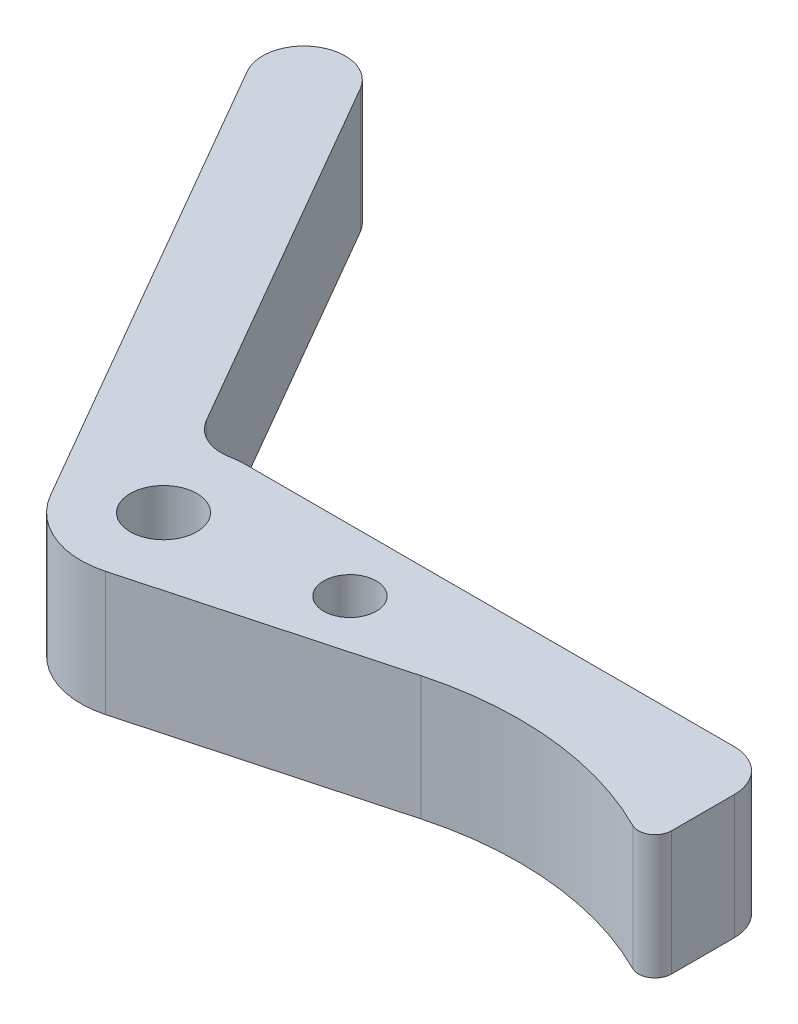
ISO-10303-21;
HEADER;
FILE_DESCRIPTION(('STEP AP214'),'2;1');
FILE_NAME('part.step','',(''),(''),'','','');
FILE_SCHEMA(('AUTOMOTIVE_DESIGN { 1 0 10303 214 1 1 1 1 }'));
ENDSEC;
DATA;
#1=APPLICATION_CONTEXT('core data for automotive mechanical design processes');
#2=APPLICATION_PROTOCOL_DEFINITION('international standard','automotive_design',2000,#1);
#3=PRODUCT_CONTEXT('',#1,'mechanical');
#4=PRODUCT('Part','Part','',(#3));
#5=PRODUCT_RELATED_PRODUCT_CATEGORY('part','',(#4));
#6=PRODUCT_DEFINITION_FORMATION('','',#4);
#7=PRODUCT_DEFINITION_CONTEXT('part definition',#1,'design');
#8=PRODUCT_DEFINITION('design','',#6,#7);
#9=PRODUCT_DEFINITION_SHAPE('','',#8);
#10=(LENGTH_UNIT() NAMED_UNIT(*) SI_UNIT(.MILLI.,.METRE.));
#11=(NAMED_UNIT(*) PLANE_ANGLE_UNIT() SI_UNIT($,.RADIAN.));
#12=(NAMED_UNIT(*) SI_UNIT($,.STERADIAN.) SOLID_ANGLE_UNIT());
#13=UNCERTAINTY_MEASURE_WITH_UNIT(LENGTH_MEASURE(1.E-05),#10,'distance_accuracy_value','');
#14=(GEOMETRIC_REPRESENTATION_CONTEXT(3) GLOBAL_UNCERTAINTY_ASSIGNED_CONTEXT((#13)) GLOBAL_UNIT_ASSIGNED_CONTEXT((#10,
#11,#12)) REPRESENTATION_CONTEXT('',''));
#15=CARTESIAN_POINT('',(0.,0.,0.));
#16=DIRECTION('',(0.,0.,1.));
#17=DIRECTION('',(1.,0.,0.));
#18=AXIS2_PLACEMENT_3D('',#15,#16,#17);
#19=CARTESIAN_POINT('',(0.,9.525,0.));
#20=DIRECTION('',(0.,-1.,0.));
#21=DIRECTION('',(0.,0.,-1.));
#22=AXIS2_PLACEMENT_3D('',#19,#20,#21);
#23=CYLINDRICAL_SURFACE('',#22,6.35);
#24=CARTESIAN_POINT('',(0.,0.,0.));
#25=DIRECTION('',(0.,1.,0.));
#26=DIRECTION('',(0.,0.,1.));
#27=AXIS2_PLACEMENT_3D('',#24,#25,#26);
#28=CIRCLE('',#27,6.35);
#29=CARTESIAN_POINT('',(-5.49926131403119,0.,3.175));
#30=VERTEX_POINT('',#29);
#31=CARTESIAN_POINT('',(1.66397149352057,0.,6.12810728273836));
#32=VERTEX_POINT('',#31);
#33=EDGE_CURVE('E169',#30,#32,#28,.T.);
#34=ORIENTED_EDGE('',*,*,#33,.T.);
#35=DIRECTION('',(0.,-1.,0.));
#36=VECTOR('',#35,1.);
#37=CARTESIAN_POINT('',(1.66397149352057,9.525,6.12810728273836));
#38=LINE('',#37,#36);
#39=CARTESIAN_POINT('',(1.66397149352057,9.525,6.12810728273836));
#40=VERTEX_POINT('',#39);
#41=EDGE_CURVE('E150',#40,#32,#38,.T.);
#42=ORIENTED_EDGE('',*,*,#41,.F.);
#43=CARTESIAN_POINT('',(0.,9.525,0.));
#44=DIRECTION('',(0.,1.,0.));
#45=DIRECTION('',(0.,0.,1.));
#46=AXIS2_PLACEMENT_3D('',#43,#44,#45);
#47=CIRCLE('',#46,6.35);
#48=CARTESIAN_POINT('',(-5.49926131403119,9.525,3.175));
#49=VERTEX_POINT('',#48);
#50=EDGE_CURVE('E156',#49,#40,#47,.T.);
#51=ORIENTED_EDGE('',*,*,#50,.F.);
#52=DIRECTION('',(0.,-1.,0.));
#53=VECTOR('',#52,1.);
#54=CARTESIAN_POINT('',(-5.49926131403119,9.525,3.175));
#55=LINE('',#54,#53);
#56=EDGE_CURVE('E241',#49,#30,#55,.T.);
#57=ORIENTED_EDGE('',*,*,#56,.T.);
#58=EDGE_LOOP('',(#34,#42,#51,#57));
#59=FACE_BOUND('',#58,.T.);
#60=ADVANCED_FACE('F51',(#59),#23,.T.);
#61=CARTESIAN_POINT('',(1.66397149352057,9.525,6.12810728273836));
#62=DIRECTION('',(-0.26204275488513,0.,-0.965056264998167));
#63=DIRECTION('',(-0.965056264998167,0.,0.26204275488513));
#64=AXIS2_PLACEMENT_3D('',#61,#62,#63);
#65=PLANE('',#64);
#66=DIRECTION('',(0.965056264998167,0.,-0.26204275488513));
#67=VECTOR('',#66,1.);
#68=CARTESIAN_POINT('',(1.66397149352057,0.,6.12810728273836));
#69=LINE('',#68,#67);
#70=CARTESIAN_POINT('',(20.7139714935206,0.,0.955440505044106));
#71=VERTEX_POINT('',#70);
#72=EDGE_CURVE('E232',#32,#71,#69,.T.);
#73=ORIENTED_EDGE('',*,*,#72,.T.);
#74=DIRECTION('',(0.,-1.,0.));
#75=VECTOR('',#74,1.);
#76=CARTESIAN_POINT('',(20.7139714935206,9.525,0.955440505044106));
#77=LINE('',#76,#75);
#78=CARTESIAN_POINT('',(20.7139714935206,9.525,0.955440505044106));
#79=VERTEX_POINT('',#78);
#80=EDGE_CURVE('E153',#79,#71,#77,.T.);
#81=ORIENTED_EDGE('',*,*,#80,.F.);
#82=DIRECTION('',(0.965056264998167,0.,-0.26204275488513));
#83=VECTOR('',#82,1.);
#84=CARTESIAN_POINT('',(1.66397149352057,9.525,6.12810728273836));
#85=LINE('',#84,#83);
#86=EDGE_CURVE('E146',#40,#79,#85,.T.);
#87=ORIENTED_EDGE('',*,*,#86,.F.);
#88=ORIENTED_EDGE('',*,*,#41,.T.);
#89=EDGE_LOOP('',(#73,#81,#87,#88));
#90=FACE_BOUND('',#89,.T.);
#91=ADVANCED_FACE('F148',(#90),#65,.F.);
#92=CARTESIAN_POINT('',(27.3698574676029,9.525,25.4678696359975));
#93=DIRECTION('',(0.,-1.,0.));
#94=DIRECTION('',(0.,0.,-1.));
#95=AXIS2_PLACEMENT_3D('',#92,#93,#94);
#96=CYLINDRICAL_SURFACE('',#95,25.4);
#97=CARTESIAN_POINT('',(27.3698574676029,0.,25.4678696359975));
#98=DIRECTION('',(0.,1.,0.));
#99=DIRECTION('',(0.,0.,1.));
#100=AXIS2_PLACEMENT_3D('',#97,#98,#99);
#101=CIRCLE('',#100,25.4);
#102=CARTESIAN_POINT('',(38.7985646413144,0.,2.78429292645824));
#103=VERTEX_POINT('',#102);
#104=EDGE_CURVE('E228',#71,#103,#101,.F.);
#105=ORIENTED_EDGE('',*,*,#104,.T.);
#106=DIRECTION('',(0.,-1.,0.));
#107=VECTOR('',#106,1.);
#108=CARTESIAN_POINT('',(38.7985646413144,9.525,2.78429292645824));
#109=LINE('',#108,#107);
#110=CARTESIAN_POINT('',(38.7985646413144,9.525,2.78429292645824));
#111=VERTEX_POINT('',#110);
#112=EDGE_CURVE('E59',#103,#111,#109,.F.);
#113=ORIENTED_EDGE('',*,*,#112,.T.);
#114=CARTESIAN_POINT('',(27.3698574676029,9.525,25.4678696359975));
#115=DIRECTION('',(0.,1.,0.));
#116=DIRECTION('',(0.,0.,1.));
#117=AXIS2_PLACEMENT_3D('',#114,#115,#116);
#118=CIRCLE('',#117,25.4);
#119=EDGE_CURVE('E155',#79,#111,#118,.F.);
#120=ORIENTED_EDGE('',*,*,#119,.F.);
#121=ORIENTED_EDGE('',*,*,#80,.T.);
#122=EDGE_LOOP('',(#105,#113,#120,#121));
#123=FACE_BOUND('',#122,.T.);
#124=ADVANCED_FACE('F270',(#123),#96,.F.);
#125=CARTESIAN_POINT('',(40.64,9.525,0.));
#126=DIRECTION('',(1.,0.,0.));
#127=DIRECTION('',(0.,0.,-1.));
#128=AXIS2_PLACEMENT_3D('',#125,#126,#127);
#129=PLANE('',#128);
#130=DIRECTION('',(0.,0.,1.));
#131=VECTOR('',#130,1.);
#132=CARTESIAN_POINT('',(40.64,9.525,0.));
#133=LINE('',#132,#131);
#134=CARTESIAN_POINT('',(40.64,9.525,-3.175));
#135=VERTEX_POINT('',#134);
#136=CARTESIAN_POINT('',(40.64,9.525,1.65011409098128));
#137=VERTEX_POINT('',#136);
#138=EDGE_CURVE('E222',#135,#137,#133,.T.);
#139=ORIENTED_EDGE('',*,*,#138,.T.);
#140=DIRECTION('',(0.,1.,0.));
#141=VECTOR('',#140,1.);
#142=CARTESIAN_POINT('',(40.64,0.,1.65011409098128));
#143=LINE('',#142,#141);
#144=CARTESIAN_POINT('',(40.64,0.,1.65011409098128));
#145=VERTEX_POINT('',#144);
#146=EDGE_CURVE('E206',#137,#145,#143,.F.);
#147=ORIENTED_EDGE('',*,*,#146,.T.);
#148=DIRECTION('',(0.,0.,1.));
#149=VECTOR('',#148,1.);
#150=CARTESIAN_POINT('',(40.64,0.,0.));
#151=LINE('',#150,#149);
#152=CARTESIAN_POINT('',(40.64,0.,-3.175));
#153=VERTEX_POINT('',#152);
#154=EDGE_CURVE('E219',#153,#145,#151,.T.);
#155=ORIENTED_EDGE('',*,*,#154,.F.);
#156=DIRECTION('',(0.,-1.,0.));
#157=VECTOR('',#156,1.);
#158=CARTESIAN_POINT('',(40.64,9.525,-3.175));
#159=LINE('',#158,#157);
#160=EDGE_CURVE('E200',#153,#135,#159,.F.);
#161=ORIENTED_EDGE('',*,*,#160,.T.);
#162=EDGE_LOOP('',(#139,#147,#155,#161));
#163=FACE_BOUND('',#162,.T.);
#164=ADVANCED_FACE('F218',(#163),#129,.T.);
#165=CARTESIAN_POINT('',(0.,9.525,-6.35));
#166=DIRECTION('',(0.,0.,-1.));
#167=DIRECTION('',(-1.,0.,0.));
#168=AXIS2_PLACEMENT_3D('',#165,#166,#167);
#169=PLANE('',#168);
#170=DIRECTION('',(1.,0.,0.));
#171=VECTOR('',#170,1.);
#172=CARTESIAN_POINT('',(0.,9.525,-6.35));
#173=LINE('',#172,#171);
#174=CARTESIAN_POINT('',(0.,9.525,-6.35));
#175=VERTEX_POINT('',#174);
#176=CARTESIAN_POINT('',(37.465,9.525,-6.35));
#177=VERTEX_POINT('',#176);
#178=EDGE_CURVE('E257',#175,#177,#173,.T.);
#179=ORIENTED_EDGE('',*,*,#178,.T.);
#180=DIRECTION('',(0.,-1.,0.));
#181=VECTOR('',#180,1.);
#182=CARTESIAN_POINT('',(37.465,9.525,-6.35));
#183=LINE('',#182,#181);
#184=CARTESIAN_POINT('',(37.465,0.,-6.35));
#185=VERTEX_POINT('',#184);
#186=EDGE_CURVE('E197',#177,#185,#183,.T.);
#187=ORIENTED_EDGE('',*,*,#186,.T.);
#188=DIRECTION('',(1.,0.,0.));
#189=VECTOR('',#188,1.);
#190=CARTESIAN_POINT('',(0.,0.,-6.35));
#191=LINE('',#190,#189);
#192=CARTESIAN_POINT('',(0.,0.,-6.35));
#193=VERTEX_POINT('',#192);
#194=EDGE_CURVE('E227',#193,#185,#191,.T.);
#195=ORIENTED_EDGE('',*,*,#194,.F.);
#196=DIRECTION('',(0.,-1.,0.));
#197=VECTOR('',#196,1.);
#198=CARTESIAN_POINT('',(0.,9.525,-6.35));
#199=LINE('',#198,#197);
#200=EDGE_CURVE('E175',#175,#193,#199,.T.);
#201=ORIENTED_EDGE('',*,*,#200,.F.);
#202=EDGE_LOOP('',(#179,#187,#195,#201));
#203=FACE_BOUND('',#202,.T.);
#204=ADVANCED_FACE('F255',(#203),#169,.T.);
#205=CARTESIAN_POINT('',(-1.16033160234599,0.,-6.24308662222439));
#206=VERTEX_POINT('',#205);
#207=EDGE_CURVE('E230',#193,#206,#28,.T.);
#208=ORIENTED_EDGE('',*,*,#207,.T.);
#209=DIRECTION('',(0.,-1.,0.));
#210=VECTOR('',#209,1.);
#211=CARTESIAN_POINT('',(-1.16033160234599,9.525,-6.24308662222439));
#212=LINE('',#211,#210);
#213=CARTESIAN_POINT('',(-1.16033160234599,9.525,-6.24308662222439));
#214=VERTEX_POINT('',#213);
#215=EDGE_CURVE('E195',#206,#214,#212,.F.);
#216=ORIENTED_EDGE('',*,*,#215,.T.);
#217=EDGE_CURVE('E167',#175,#214,#47,.T.);
#218=ORIENTED_EDGE('',*,*,#217,.F.);
#219=ORIENTED_EDGE('',*,*,#200,.T.);
#220=EDGE_LOOP('',(#208,#216,#218,#219));
#221=FACE_BOUND('',#220,.T.);
#222=ADVANCED_FACE('F246',(#221),#23,.T.);
#223=CARTESIAN_POINT('',(0.,9.525,0.));
#224=DIRECTION('',(-0.866025403784439,0.,0.499999999999999));
#225=DIRECTION('',(0.5,0.,0.866025403784439));
#226=AXIS2_PLACEMENT_3D('',#223,#224,#225);
#227=PLANE('',#226);
#228=DIRECTION('',(-0.5,0.,-0.866025403784439));
#229=VECTOR('',#228,1.);
#230=CARTESIAN_POINT('',(0.,0.,0.));
#231=LINE('',#230,#229);
#232=CARTESIAN_POINT('',(-4.49012806053458,0.,-7.77712993333659));
#233=VERTEX_POINT('',#232);
#234=CARTESIAN_POINT('',(-20.6375,0.,-35.7451985412028));
#235=VERTEX_POINT('',#234);
#236=EDGE_CURVE('E236',#233,#235,#231,.T.);
#237=ORIENTED_EDGE('',*,*,#236,.T.);
#238=DIRECTION('',(0.,-1.,0.));
#239=VECTOR('',#238,1.);
#240=CARTESIAN_POINT('',(-20.6375,9.525,-35.7451985412027));
#241=LINE('',#240,#239);
#242=CARTESIAN_POINT('',(-20.6375,9.525,-35.7451985412028));
#243=VERTEX_POINT('',#242);
#244=EDGE_CURVE('E193',#235,#243,#241,.F.);
#245=ORIENTED_EDGE('',*,*,#244,.T.);
#246=DIRECTION('',(-0.5,0.,-0.866025403784439));
#247=VECTOR('',#246,1.);
#248=CARTESIAN_POINT('',(0.,9.525,0.));
#249=LINE('',#248,#247);
#250=CARTESIAN_POINT('',(-4.49012806053458,9.525,-7.77712993333659));
#251=VERTEX_POINT('',#250);
#252=EDGE_CURVE('E265',#251,#243,#249,.T.);
#253=ORIENTED_EDGE('',*,*,#252,.F.);
#254=DIRECTION('',(0.,1.,0.));
#255=VECTOR('',#254,1.);
#256=CARTESIAN_POINT('',(-4.49012806053457,0.,-7.77712993333659));
#257=LINE('',#256,#255);
#258=EDGE_CURVE('E190',#251,#233,#257,.F.);
#259=ORIENTED_EDGE('',*,*,#258,.T.);
#260=EDGE_LOOP('',(#237,#245,#253,#259));
#261=FACE_BOUND('',#260,.T.);
#262=ADVANCED_FACE('F289',(#261),#227,.F.);
#263=CARTESIAN_POINT('',(0.,9.525,0.));
#264=DIRECTION('',(0.,-1.,0.));
#265=DIRECTION('',(0.,0.,-1.));
#266=AXIS2_PLACEMENT_3D('',#263,#264,#265);
#267=CYLINDRICAL_SURFACE('',#266,2.5527);
#268=CARTESIAN_POINT('',(0.,9.525,0.));
#269=DIRECTION('',(0.,1.,0.));
#270=DIRECTION('',(0.,0.,1.));
#271=AXIS2_PLACEMENT_3D('',#268,#269,#270);
#272=CIRCLE('',#271,2.5527);
#273=CARTESIAN_POINT('',(0.,9.525,-2.5527));
#274=VERTEX_POINT('',#273);
#275=EDGE_CURVE('E165',#274,#274,#272,.T.);
#276=CARTESIAN_POINT('',(0.,0.,0.));
#277=DIRECTION('',(0.,1.,0.));
#278=DIRECTION('',(0.,0.,1.));
#279=AXIS2_PLACEMENT_3D('',#276,#277,#278);
#280=CIRCLE('',#279,2.5527);
#281=CARTESIAN_POINT('',(0.,0.,-2.5527));
#282=VERTEX_POINT('',#281);
#283=EDGE_CURVE('E210',#282,#282,#280,.T.);
#284=CARTESIAN_POINT('',(0.,9.525,-2.5527));
#285=CARTESIAN_POINT('',(0.,9.42578125,-2.5527));
#286=CARTESIAN_POINT('',(0.,9.3265625,-2.5527));
#287=CARTESIAN_POINT('',(0.,9.128125,-2.5527));
#288=CARTESIAN_POINT('',(0.,9.02890625,-2.5527));
#289=CARTESIAN_POINT('',(0.,8.83046875,-2.5527));
#290=CARTESIAN_POINT('',(0.,8.73125,-2.5527));
#291=CARTESIAN_POINT('',(0.,8.5328125,-2.5527));
#292=CARTESIAN_POINT('',(0.,8.43359375,-2.5527));
#293=CARTESIAN_POINT('',(0.,8.23515625,-2.5527));
#294=CARTESIAN_POINT('',(0.,8.1359375,-2.5527));
#295=CARTESIAN_POINT('',(0.,7.9375,-2.5527));
#296=CARTESIAN_POINT('',(0.,7.83828125,-2.5527));
#297=CARTESIAN_POINT('',(0.,7.63984375,-2.5527));
#298=CARTESIAN_POINT('',(0.,7.540625,-2.5527));
#299=CARTESIAN_POINT('',(0.,7.3421875,-2.5527));
#300=CARTESIAN_POINT('',(0.,7.24296875,-2.5527));
#301=CARTESIAN_POINT('',(0.,7.04453125,-2.5527));
#302=CARTESIAN_POINT('',(0.,6.9453125,-2.5527));
#303=CARTESIAN_POINT('',(0.,6.746875,-2.5527));
#304=CARTESIAN_POINT('',(0.,6.64765625,-2.5527));
#305=CARTESIAN_POINT('',(0.,6.44921875,-2.5527));
#306=CARTESIAN_POINT('',(0.,6.35,-2.5527));
#307=CARTESIAN_POINT('',(0.,6.1515625,-2.5527));
#308=CARTESIAN_POINT('',(0.,6.05234375,-2.5527));
#309=CARTESIAN_POINT('',(0.,5.85390625,-2.5527));
#310=CARTESIAN_POINT('',(0.,5.7546875,-2.5527));
#311=CARTESIAN_POINT('',(0.,5.55625,-2.5527));
#312=CARTESIAN_POINT('',(0.,5.45703125,-2.5527));
#313=CARTESIAN_POINT('',(0.,5.25859375,-2.5527));
#314=CARTESIAN_POINT('',(0.,5.159375,-2.5527));
#315=CARTESIAN_POINT('',(0.,4.9609375,-2.5527));
#316=CARTESIAN_POINT('',(0.,4.86171875,-2.5527));
#317=CARTESIAN_POINT('',(0.,4.66328125,-2.5527));
#318=CARTESIAN_POINT('',(0.,4.5640625,-2.5527));
#319=CARTESIAN_POINT('',(0.,4.365625,-2.5527));
#320=CARTESIAN_POINT('',(0.,4.26640625,-2.5527));
#321=CARTESIAN_POINT('',(0.,4.06796875,-2.5527));
#322=CARTESIAN_POINT('',(0.,3.96875,-2.5527));
#323=CARTESIAN_POINT('',(0.,3.7703125,-2.5527));
#324=CARTESIAN_POINT('',(0.,3.67109375,-2.5527));
#325=CARTESIAN_POINT('',(0.,3.47265625,-2.5527));
#326=CARTESIAN_POINT('',(0.,3.3734375,-2.5527));
#327=CARTESIAN_POINT('',(0.,3.175,-2.5527));
#328=CARTESIAN_POINT('',(0.,3.07578125,-2.5527));
#329=CARTESIAN_POINT('',(0.,2.87734375,-2.5527));
#330=CARTESIAN_POINT('',(0.,2.778125,-2.5527));
#331=CARTESIAN_POINT('',(0.,2.5796875,-2.5527));
#332=CARTESIAN_POINT('',(0.,2.48046875,-2.5527));
#333=CARTESIAN_POINT('',(0.,2.28203125,-2.5527));
#334=CARTESIAN_POINT('',(0.,2.1828125,-2.5527));
#335=CARTESIAN_POINT('',(0.,1.984375,-2.5527));
#336=CARTESIAN_POINT('',(0.,1.88515625,-2.5527));
#337=CARTESIAN_POINT('',(0.,1.68671875,-2.5527));
#338=CARTESIAN_POINT('',(0.,1.5875,-2.5527));
#339=CARTESIAN_POINT('',(0.,1.3890625,-2.5527));
#340=CARTESIAN_POINT('',(0.,1.28984375,-2.5527));
#341=CARTESIAN_POINT('',(0.,1.09140625,-2.5527));
#342=CARTESIAN_POINT('',(0.,0.992187500000001,-2.5527));
#343=CARTESIAN_POINT('',(0.,0.793750000000001,-2.5527));
#344=CARTESIAN_POINT('',(0.,0.69453125,-2.5527));
#345=CARTESIAN_POINT('',(0.,0.49609375,-2.5527));
#346=CARTESIAN_POINT('',(0.,0.396875,-2.5527));
#347=CARTESIAN_POINT('',(0.,0.1984375,-2.5527));
#348=CARTESIAN_POINT('',(0.,0.0992187500000001,-2.5527));
#349=CARTESIAN_POINT('',(0.,0.,-2.5527));
#350=B_SPLINE_CURVE_WITH_KNOTS('',3,(#284,#285,#286,#287,#288,#289,#290,#291,#292,#293,#294,
#295,#296,#297,#298,#299,#300,#301,#302,#303,#304,#305,#306,#307,#308,#309,#310,#311,#312,#313,
#314,#315,#316,#317,#318,#319,#320,#321,#322,#323,#324,#325,#326,#327,#328,#329,#330,#331,#332,
#333,#334,#335,#336,#337,#338,#339,#340,#341,#342,#343,#344,#345,#346,#347,#348,#349),
.UNSPECIFIED.,.F.,.F.,(4,2,2,2,2,2,2,2,2,2,2,2,2,2,2,2,2,2,2,2,2,2,2,2,2,2,2,2,2,2,2,2,4),(0.,
0.29765625,0.5953125,0.892968750000001,1.190625,1.48828125,1.7859375,2.08359375,2.38125,
2.67890625,2.9765625,3.27421875,3.571875,3.86953125,4.1671875,4.46484375,4.7625,5.06015625,
5.3578125,5.65546875,5.953125,6.25078125,6.5484375,6.84609375,7.14375,7.44140625,7.7390625,
8.03671875,8.334375,8.63203125,8.9296875,9.22734375,9.525),.UNSPECIFIED.);
#351=EDGE_CURVE('BSEAM294',#274,#282,#350,.T.);
#352=ORIENTED_EDGE('',*,*,#275,.T.);
#353=ORIENTED_EDGE('',*,*,#283,.F.);
#354=ORIENTED_EDGE('',*,*,#351,.T.);
#355=ORIENTED_EDGE('',*,*,#351,.F.);
#356=EDGE_LOOP('',(#352,#354,#353,#355));
#357=FACE_BOUND('',#356,.T.);
#358=ADVANCED_FACE('F294',(#357),#267,.F.);
#359=CARTESIAN_POINT('',(-5.49926131403119,9.525,3.175));
#360=DIRECTION('',(0.866025403784439,0.,-0.499999999999999));
#361=DIRECTION('',(-0.5,0.,-0.866025403784439));
#362=AXIS2_PLACEMENT_3D('',#359,#360,#361);
#363=PLANE('',#362);
#364=DIRECTION('',(0.5,0.,0.866025403784439));
#365=VECTOR('',#364,1.);
#366=CARTESIAN_POINT('',(-5.49926131403119,9.525,3.175));
#367=LINE('',#366,#365);
#368=CARTESIAN_POINT('',(-26.1367613140312,9.525,-32.5701985412028));
#369=VERTEX_POINT('',#368);
#370=EDGE_CURVE('E161',#369,#49,#367,.T.);
#371=ORIENTED_EDGE('',*,*,#370,.F.);
#372=DIRECTION('',(0.,-1.,0.));
#373=VECTOR('',#372,1.);
#374=CARTESIAN_POINT('',(-26.1367613140312,9.525,-32.5701985412027));
#375=LINE('',#374,#373);
#376=CARTESIAN_POINT('',(-26.1367613140312,0.,-32.5701985412028));
#377=VERTEX_POINT('',#376);
#378=EDGE_CURVE('E170',#369,#377,#375,.T.);
#379=ORIENTED_EDGE('',*,*,#378,.T.);
#380=DIRECTION('',(0.5,0.,0.866025403784439));
#381=VECTOR('',#380,1.);
#382=CARTESIAN_POINT('',(-5.49926131403119,0.,3.175));
#383=LINE('',#382,#381);
#384=EDGE_CURVE('E239',#377,#30,#383,.T.);
#385=ORIENTED_EDGE('',*,*,#384,.T.);
#386=ORIENTED_EDGE('',*,*,#56,.F.);
#387=EDGE_LOOP('',(#371,#379,#385,#386));
#388=FACE_BOUND('',#387,.T.);
#389=ADVANCED_FACE('F305',(#388),#363,.F.);
#390=CARTESIAN_POINT('',(0.,9.525,0.));
#391=DIRECTION('',(0.,1.,0.));
#392=DIRECTION('',(0.,0.,1.));
#393=AXIS2_PLACEMENT_3D('',#390,#391,#392);
#394=PLANE('',#393);
#395=CARTESIAN_POINT('',(12.7,9.525,-1.60925864244061));
#396=DIRECTION('',(0.,1.,0.));
#397=DIRECTION('',(0.,0.,1.));
#398=AXIS2_PLACEMENT_3D('',#395,#396,#397);
#399=CIRCLE('',#398,2.0193);
#400=CARTESIAN_POINT('',(12.7,9.525,0.410041357559393));
#401=VERTEX_POINT('',#400);
#402=EDGE_CURVE('E349',#401,#401,#399,.T.);
#403=ORIENTED_EDGE('',*,*,#402,.F.);
#404=EDGE_LOOP('',(#403));
#405=FACE_BOUND('',#404,.T.);
#406=ORIENTED_EDGE('',*,*,#275,.F.);
#407=EDGE_LOOP('',(#406));
#408=FACE_BOUND('',#407,.T.);
#409=ORIENTED_EDGE('',*,*,#119,.T.);
#410=CARTESIAN_POINT('',(39.37,9.525,1.65011409098128));
#411=DIRECTION('',(0.,1.,0.));
#412=DIRECTION('',(0.,0.,1.));
#413=AXIS2_PLACEMENT_3D('',#410,#411,#412);
#414=CIRCLE('',#413,1.27);
#415=EDGE_CURVE('E11',#111,#137,#414,.T.);
#416=ORIENTED_EDGE('',*,*,#415,.T.);
#417=ORIENTED_EDGE('',*,*,#138,.F.);
#418=CARTESIAN_POINT('',(37.465,9.525,-3.175));
#419=DIRECTION('',(0.,1.,0.));
#420=DIRECTION('',(0.,0.,1.));
#421=AXIS2_PLACEMENT_3D('',#418,#419,#420);
#422=CIRCLE('',#421,3.175);
#423=EDGE_CURVE('E184',#135,#177,#422,.T.);
#424=ORIENTED_EDGE('',*,*,#423,.T.);
#425=ORIENTED_EDGE('',*,*,#178,.F.);
#426=ORIENTED_EDGE('',*,*,#217,.T.);
#427=CARTESIAN_POINT('',(-1.74049740351898,9.525,-9.36462993333659));
#428=DIRECTION('',(0.,1.,0.));
#429=DIRECTION('',(0.,0.,1.));
#430=AXIS2_PLACEMENT_3D('',#427,#428,#429);
#431=CIRCLE('',#430,3.175);
#432=EDGE_CURVE('E204',#214,#251,#431,.F.);
#433=ORIENTED_EDGE('',*,*,#432,.T.);
#434=ORIENTED_EDGE('',*,*,#252,.T.);
#435=CARTESIAN_POINT('',(-23.3871306570156,9.525,-34.1576985412027));
#436=DIRECTION('',(0.,1.,0.));
#437=DIRECTION('',(0.,0.,1.));
#438=AXIS2_PLACEMENT_3D('',#435,#436,#437);
#439=CIRCLE('',#438,3.175);
#440=CARTESIAN_POINT('',(-24.9746306570156,9.525,-36.9073291982183));
#441=VERTEX_POINT('',#440);
#442=EDGE_CURVE('E186',#243,#441,#439,.T.);
#443=ORIENTED_EDGE('',*,*,#442,.T.);
#444=CARTESIAN_POINT('',(-23.3871306570156,9.525,-34.1576985412027));
#445=DIRECTION('',(0.,1.,0.));
#446=DIRECTION('',(0.,0.,1.));
#447=AXIS2_PLACEMENT_3D('',#444,#445,#446);
#448=CIRCLE('',#447,3.175);
#449=EDGE_CURVE('E188',#441,#369,#448,.T.);
#450=ORIENTED_EDGE('',*,*,#449,.T.);
#451=ORIENTED_EDGE('',*,*,#370,.T.);
#452=ORIENTED_EDGE('',*,*,#50,.T.);
#453=ORIENTED_EDGE('',*,*,#86,.T.);
#454=EDGE_LOOP('',(#409,#416,#417,#424,#425,#426,#433,#434,#443,#450,#451,#452,#453));
#455=FACE_BOUND('',#454,.T.);
#456=ADVANCED_FACE('F159',(#405,#408,#455),#394,.T.);
#457=CARTESIAN_POINT('',(0.,0.,0.));
#458=DIRECTION('',(0.,1.,0.));
#459=DIRECTION('',(0.,0.,1.));
#460=AXIS2_PLACEMENT_3D('',#457,#458,#459);
#461=PLANE('',#460);
#462=CARTESIAN_POINT('',(12.7,0.,-1.60925864244061));
#463=DIRECTION('',(0.,1.,0.));
#464=DIRECTION('',(0.,0.,1.));
#465=AXIS2_PLACEMENT_3D('',#462,#463,#464);
#466=CIRCLE('',#465,2.0193);
#467=CARTESIAN_POINT('',(12.7,0.,0.410041357559392));
#468=VERTEX_POINT('',#467);
#469=EDGE_CURVE('E211',#468,#468,#466,.T.);
#470=ORIENTED_EDGE('',*,*,#469,.T.);
#471=EDGE_LOOP('',(#470));
#472=FACE_BOUND('',#471,.T.);
#473=ORIENTED_EDGE('',*,*,#283,.T.);
#474=EDGE_LOOP('',(#473));
#475=FACE_BOUND('',#474,.T.);
#476=ORIENTED_EDGE('',*,*,#154,.T.);
#477=CARTESIAN_POINT('',(39.37,0.,1.65011409098128));
#478=DIRECTION('',(0.,1.,0.));
#479=DIRECTION('',(0.,0.,1.));
#480=AXIS2_PLACEMENT_3D('',#477,#478,#479);
#481=CIRCLE('',#480,1.27);
#482=EDGE_CURVE('E73',#145,#103,#481,.F.);
#483=ORIENTED_EDGE('',*,*,#482,.T.);
#484=ORIENTED_EDGE('',*,*,#104,.F.);
#485=ORIENTED_EDGE('',*,*,#72,.F.);
#486=ORIENTED_EDGE('',*,*,#33,.F.);
#487=ORIENTED_EDGE('',*,*,#384,.F.);
#488=CARTESIAN_POINT('',(-23.3871306570156,0.,-34.1576985412027));
#489=DIRECTION('',(0.,1.,0.));
#490=DIRECTION('',(0.,0.,1.));
#491=AXIS2_PLACEMENT_3D('',#488,#489,#490);
#492=CIRCLE('',#491,3.175);
#493=CARTESIAN_POINT('',(-24.9746306570156,0.,-36.9073291982183));
#494=VERTEX_POINT('',#493);
#495=EDGE_CURVE('E182',#377,#494,#492,.F.);
#496=ORIENTED_EDGE('',*,*,#495,.T.);
#497=CARTESIAN_POINT('',(-23.3871306570156,0.,-34.1576985412027));
#498=DIRECTION('',(0.,1.,0.));
#499=DIRECTION('',(0.,0.,1.));
#500=AXIS2_PLACEMENT_3D('',#497,#498,#499);
#501=CIRCLE('',#500,3.175);
#502=EDGE_CURVE('E180',#494,#235,#501,.F.);
#503=ORIENTED_EDGE('',*,*,#502,.T.);
#504=ORIENTED_EDGE('',*,*,#236,.F.);
#505=CARTESIAN_POINT('',(-1.74049740351898,0.,-9.36462993333659));
#506=DIRECTION('',(0.,1.,0.));
#507=DIRECTION('',(0.,0.,1.));
#508=AXIS2_PLACEMENT_3D('',#505,#506,#507);
#509=CIRCLE('',#508,3.175);
#510=EDGE_CURVE('E202',#233,#206,#509,.T.);
#511=ORIENTED_EDGE('',*,*,#510,.T.);
#512=ORIENTED_EDGE('',*,*,#207,.F.);
#513=ORIENTED_EDGE('',*,*,#194,.T.);
#514=CARTESIAN_POINT('',(37.465,0.,-3.175));
#515=DIRECTION('',(0.,1.,0.));
#516=DIRECTION('',(0.,0.,1.));
#517=AXIS2_PLACEMENT_3D('',#514,#515,#516);
#518=CIRCLE('',#517,3.175);
#519=EDGE_CURVE('E173',#185,#153,#518,.F.);
#520=ORIENTED_EDGE('',*,*,#519,.T.);
#521=EDGE_LOOP('',(#476,#483,#484,#485,#486,#487,#496,#503,#504,#511,#512,#513,#520));
#522=FACE_BOUND('',#521,.T.);
#523=ADVANCED_FACE('F225',(#472,#475,#522),#461,.F.);
#524=CARTESIAN_POINT('',(-23.3871306570156,9.525,-34.1576985412027));
#525=DIRECTION('',(0.,-1.,0.));
#526=DIRECTION('',(0.,0.,-1.));
#527=AXIS2_PLACEMENT_3D('',#524,#525,#526);
#528=CYLINDRICAL_SURFACE('',#527,3.175);
#529=DIRECTION('',(0.,-1.,0.));
#530=VECTOR('',#529,1.);
#531=CARTESIAN_POINT('',(-24.9746306570156,9.525,-36.9073291982183));
#532=LINE('',#531,#530);
#533=EDGE_CURVE('E207',#441,#494,#532,.T.);
#534=ORIENTED_EDGE('',*,*,#533,.F.);
#535=ORIENTED_EDGE('',*,*,#442,.F.);
#536=ORIENTED_EDGE('',*,*,#244,.F.);
#537=ORIENTED_EDGE('',*,*,#502,.F.);
#538=EDGE_LOOP('',(#534,#535,#536,#537));
#539=FACE_BOUND('',#538,.T.);
#540=ADVANCED_FACE('F310',(#539),#528,.T.);
#541=CARTESIAN_POINT('',(-23.3871306570156,9.525,-34.1576985412027));
#542=DIRECTION('',(0.,-1.,0.));
#543=DIRECTION('',(0.,0.,-1.));
#544=AXIS2_PLACEMENT_3D('',#541,#542,#543);
#545=CYLINDRICAL_SURFACE('',#544,3.175);
#546=ORIENTED_EDGE('',*,*,#449,.F.);
#547=ORIENTED_EDGE('',*,*,#533,.T.);
#548=ORIENTED_EDGE('',*,*,#495,.F.);
#549=ORIENTED_EDGE('',*,*,#378,.F.);
#550=EDGE_LOOP('',(#546,#547,#548,#549));
#551=FACE_BOUND('',#550,.T.);
#552=ADVANCED_FACE('F307',(#551),#545,.T.);
#553=CARTESIAN_POINT('',(-1.74049740351898,9.525,-9.36462993333659));
#554=DIRECTION('',(0.,-1.,0.));
#555=DIRECTION('',(0.,0.,-1.));
#556=AXIS2_PLACEMENT_3D('',#553,#554,#555);
#557=CYLINDRICAL_SURFACE('',#556,3.175);
#558=ORIENTED_EDGE('',*,*,#432,.F.);
#559=ORIENTED_EDGE('',*,*,#215,.F.);
#560=ORIENTED_EDGE('',*,*,#510,.F.);
#561=ORIENTED_EDGE('',*,*,#258,.F.);
#562=EDGE_LOOP('',(#558,#559,#560,#561));
#563=FACE_BOUND('',#562,.T.);
#564=ADVANCED_FACE('F279',(#563),#557,.F.);
#565=CARTESIAN_POINT('',(37.465,9.525,-3.175));
#566=DIRECTION('',(0.,-1.,0.));
#567=DIRECTION('',(0.,0.,-1.));
#568=AXIS2_PLACEMENT_3D('',#565,#566,#567);
#569=CYLINDRICAL_SURFACE('',#568,3.175);
#570=ORIENTED_EDGE('',*,*,#423,.F.);
#571=ORIENTED_EDGE('',*,*,#160,.F.);
#572=ORIENTED_EDGE('',*,*,#519,.F.);
#573=ORIENTED_EDGE('',*,*,#186,.F.);
#574=EDGE_LOOP('',(#570,#571,#572,#573));
#575=FACE_BOUND('',#574,.T.);
#576=ADVANCED_FACE('F260',(#575),#569,.T.);
#577=CARTESIAN_POINT('',(39.37,9.525,1.65011409098128));
#578=DIRECTION('',(0.,-1.,0.));
#579=DIRECTION('',(0.,0.,-1.));
#580=AXIS2_PLACEMENT_3D('',#577,#578,#579);
#581=CYLINDRICAL_SURFACE('',#580,1.27);
#582=ORIENTED_EDGE('',*,*,#415,.F.);
#583=ORIENTED_EDGE('',*,*,#112,.F.);
#584=ORIENTED_EDGE('',*,*,#482,.F.);
#585=ORIENTED_EDGE('',*,*,#146,.F.);
#586=EDGE_LOOP('',(#582,#583,#584,#585));
#587=FACE_BOUND('',#586,.T.);
#588=ADVANCED_FACE('F53',(#587),#581,.T.);
#589=CARTESIAN_POINT('',(12.7,9.525,-1.60925864244061));
#590=DIRECTION('',(0.,1.,0.));
#591=DIRECTION('',(0.,0.,1.));
#592=AXIS2_PLACEMENT_3D('',#589,#590,#591);
#593=CYLINDRICAL_SURFACE('',#592,2.0193);
#594=ORIENTED_EDGE('',*,*,#469,.F.);
#595=EDGE_LOOP('',(#594));
#596=FACE_BOUND('',#595,.T.);
#597=ORIENTED_EDGE('',*,*,#402,.T.);
#598=EDGE_LOOP('',(#597));
#599=FACE_BOUND('',#598,.T.);
#600=ADVANCED_FACE('F272',(#596,#599),#593,.F.);
#601=CLOSED_SHELL('',(#60,#91,#124,#164,#204,#222,#262,#358,#389,#456,#523,#540,#552,#564,#576,
#588,#600));
#602=MANIFOLD_SOLID_BREP('B2',#601);
#603=ADVANCED_BREP_SHAPE_REPRESENTATION('',(#18,#602),#14);
#604=SHAPE_DEFINITION_REPRESENTATION(#9,#603);
ENDSEC;
END-ISO-10303-21;
